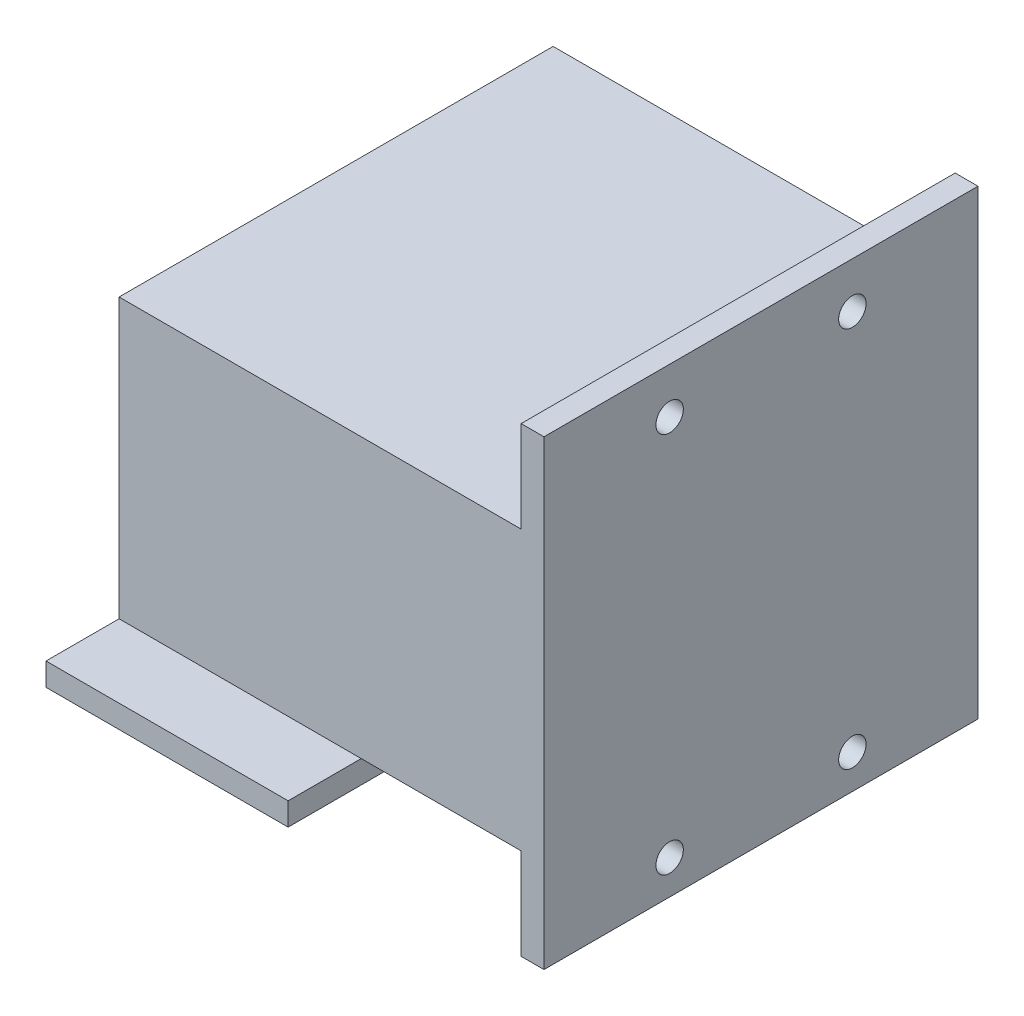
ISO-10303-21;
HEADER;
FILE_DESCRIPTION(('STEP AP214'),'2;1');
FILE_NAME('part.step','',(''),(''),'','','');
FILE_SCHEMA(('AUTOMOTIVE_DESIGN { 1 0 10303 214 1 1 1 1 }'));
ENDSEC;
DATA;
#1=APPLICATION_CONTEXT('core data for automotive mechanical design processes');
#2=APPLICATION_PROTOCOL_DEFINITION('international standard','automotive_design',2000,#1);
#3=PRODUCT_CONTEXT('',#1,'mechanical');
#4=PRODUCT('Part','Part','',(#3));
#5=PRODUCT_RELATED_PRODUCT_CATEGORY('part','',(#4));
#6=PRODUCT_DEFINITION_FORMATION('','',#4);
#7=PRODUCT_DEFINITION_CONTEXT('part definition',#1,'design');
#8=PRODUCT_DEFINITION('design','',#6,#7);
#9=PRODUCT_DEFINITION_SHAPE('','',#8);
#10=(LENGTH_UNIT() NAMED_UNIT(*) SI_UNIT(.MILLI.,.METRE.));
#11=(NAMED_UNIT(*) PLANE_ANGLE_UNIT() SI_UNIT($,.RADIAN.));
#12=(NAMED_UNIT(*) SI_UNIT($,.STERADIAN.) SOLID_ANGLE_UNIT());
#13=UNCERTAINTY_MEASURE_WITH_UNIT(LENGTH_MEASURE(1.E-05),#10,'distance_accuracy_value','');
#14=(GEOMETRIC_REPRESENTATION_CONTEXT(3) GLOBAL_UNCERTAINTY_ASSIGNED_CONTEXT((#13)) GLOBAL_UNIT_ASSIGNED_CONTEXT((#10,
#11,#12)) REPRESENTATION_CONTEXT('',''));
#15=CARTESIAN_POINT('',(0.,0.,0.));
#16=DIRECTION('',(0.,0.,1.));
#17=DIRECTION('',(1.,0.,0.));
#18=AXIS2_PLACEMENT_3D('',#15,#16,#17);
#19=CARTESIAN_POINT('',(34.2063972739642,2.5,26.204043298696));
#20=DIRECTION('',(0.,1.,0.));
#21=DIRECTION('',(0.,0.,1.));
#22=AXIS2_PLACEMENT_3D('',#19,#20,#21);
#23=PLANE('',#22);
#24=DIRECTION('',(0.,0.,1.));
#25=VECTOR('',#24,1.);
#26=CARTESIAN_POINT('',(31.7063972739642,2.50000000000001,26.204043298696));
#27=LINE('',#26,#25);
#28=CARTESIAN_POINT('',(31.7063972739642,2.50000000000001,-21.295956701304));
#29=VERTEX_POINT('',#28);
#30=CARTESIAN_POINT('',(31.7063972739642,2.50000000000001,26.204043298696));
#31=VERTEX_POINT('',#30);
#32=EDGE_CURVE('E234',#29,#31,#27,.T.);
#33=ORIENTED_EDGE('',*,*,#32,.T.);
#34=DIRECTION('',(-1.,0.,0.));
#35=VECTOR('',#34,1.);
#36=CARTESIAN_POINT('',(34.2063972739642,2.5,26.204043298696));
#37=LINE('',#36,#35);
#38=CARTESIAN_POINT('',(14.2063972739642,2.5,26.204043298696));
#39=VERTEX_POINT('',#38);
#40=EDGE_CURVE('E257',#31,#39,#37,.T.);
#41=ORIENTED_EDGE('',*,*,#40,.T.);
#42=DIRECTION('',(0.,0.,-1.));
#43=VECTOR('',#42,1.);
#44=CARTESIAN_POINT('',(14.2063972739642,2.5,26.204043298696));
#45=LINE('',#44,#43);
#46=CARTESIAN_POINT('',(14.2063972739642,2.5,-21.295956701304));
#47=VERTEX_POINT('',#46);
#48=EDGE_CURVE('E251',#39,#47,#45,.T.);
#49=ORIENTED_EDGE('',*,*,#48,.T.);
#50=DIRECTION('',(-1.,0.,0.));
#51=VECTOR('',#50,1.);
#52=CARTESIAN_POINT('',(34.2063972739642,2.5,-21.295956701304));
#53=LINE('',#52,#51);
#54=EDGE_CURVE('E210',#29,#47,#53,.T.);
#55=ORIENTED_EDGE('',*,*,#54,.F.);
#56=EDGE_LOOP('',(#33,#41,#49,#55));
#57=FACE_BOUND('',#56,.T.);
#58=ADVANCED_FACE('F43',(#57),#23,.F.);
#59=CARTESIAN_POINT('',(0.,33.,0.));
#60=DIRECTION('',(0.,1.,0.));
#61=DIRECTION('',(0.,0.,1.));
#62=AXIS2_PLACEMENT_3D('',#59,#60,#61);
#63=PLANE('',#62);
#64=DIRECTION('',(1.,0.,0.));
#65=VECTOR('',#64,1.);
#66=CARTESIAN_POINT('',(-12.2936027260358,33.,26.204043298696));
#67=LINE('',#66,#65);
#68=CARTESIAN_POINT('',(-12.2936027260358,33.,26.204043298696));
#69=VERTEX_POINT('',#68);
#70=CARTESIAN_POINT('',(31.7063972739642,33.,26.204043298696));
#71=VERTEX_POINT('',#70);
#72=EDGE_CURVE('E380',#69,#71,#67,.T.);
#73=ORIENTED_EDGE('',*,*,#72,.T.);
#74=DIRECTION('',(0.,0.,-1.));
#75=VECTOR('',#74,1.);
#76=CARTESIAN_POINT('',(31.7063972739642,33.,26.204043298696));
#77=LINE('',#76,#75);
#78=CARTESIAN_POINT('',(31.7063972739642,33.,-21.295956701304));
#79=VERTEX_POINT('',#78);
#80=EDGE_CURVE('E242',#71,#79,#77,.T.);
#81=ORIENTED_EDGE('',*,*,#80,.T.);
#82=DIRECTION('',(-1.,0.,0.));
#83=VECTOR('',#82,1.);
#84=CARTESIAN_POINT('',(-12.2936027260358,33.,-21.295956701304));
#85=LINE('',#84,#83);
#86=CARTESIAN_POINT('',(-12.2936027260358,33.,-21.295956701304));
#87=VERTEX_POINT('',#86);
#88=EDGE_CURVE('E384',#79,#87,#85,.T.);
#89=ORIENTED_EDGE('',*,*,#88,.T.);
#90=DIRECTION('',(0.,0.,1.));
#91=VECTOR('',#90,1.);
#92=CARTESIAN_POINT('',(-12.2936027260358,33.,-21.295956701304));
#93=LINE('',#92,#91);
#94=EDGE_CURVE('E377',#87,#69,#93,.T.);
#95=ORIENTED_EDGE('',*,*,#94,.T.);
#96=EDGE_LOOP('',(#73,#81,#89,#95));
#97=FACE_BOUND('',#96,.T.);
#98=ADVANCED_FACE('F422',(#97),#63,.T.);
#99=CARTESIAN_POINT('',(14.2063972739642,33.,-21.295956701304));
#100=DIRECTION('',(-1.,0.,0.));
#101=DIRECTION('',(0.,0.,1.));
#102=AXIS2_PLACEMENT_3D('',#99,#100,#101);
#103=PLANE('',#102);
#104=ORIENTED_EDGE('',*,*,#48,.F.);
#105=DIRECTION('',(0.,0.,1.));
#106=VECTOR('',#105,1.);
#107=CARTESIAN_POINT('',(14.2063972739642,2.5,26.204043298696));
#108=LINE('',#107,#106);
#109=CARTESIAN_POINT('',(14.2063972739642,2.5,34.204043298696));
#110=VERTEX_POINT('',#109);
#111=EDGE_CURVE('E304',#39,#110,#108,.T.);
#112=ORIENTED_EDGE('',*,*,#111,.T.);
#113=DIRECTION('',(0.,-1.,0.));
#114=VECTOR('',#113,1.);
#115=CARTESIAN_POINT('',(14.2063972739642,2.5,34.204043298696));
#116=LINE('',#115,#114);
#117=CARTESIAN_POINT('',(14.2063972739642,0.,34.204043298696));
#118=VERTEX_POINT('',#117);
#119=EDGE_CURVE('E310',#110,#118,#116,.T.);
#120=ORIENTED_EDGE('',*,*,#119,.T.);
#121=DIRECTION('',(0.,0.,-1.));
#122=VECTOR('',#121,1.);
#123=CARTESIAN_POINT('',(14.2063972739642,0.,-21.295956701304));
#124=LINE('',#123,#122);
#125=CARTESIAN_POINT('',(14.2063972739642,0.,-29.295956701304));
#126=VERTEX_POINT('',#125);
#127=EDGE_CURVE('E381',#118,#126,#124,.T.);
#128=ORIENTED_EDGE('',*,*,#127,.T.);
#129=DIRECTION('',(0.,-1.,0.));
#130=VECTOR('',#129,1.);
#131=CARTESIAN_POINT('',(14.2063972739642,2.5,-29.295956701304));
#132=LINE('',#131,#130);
#133=CARTESIAN_POINT('',(14.2063972739642,2.5,-29.295956701304));
#134=VERTEX_POINT('',#133);
#135=EDGE_CURVE('E259',#134,#126,#132,.T.);
#136=ORIENTED_EDGE('',*,*,#135,.F.);
#137=DIRECTION('',(0.,0.,1.));
#138=VECTOR('',#137,1.);
#139=CARTESIAN_POINT('',(14.2063972739642,2.5,-21.295956701304));
#140=LINE('',#139,#138);
#141=EDGE_CURVE('E272',#134,#47,#140,.T.);
#142=ORIENTED_EDGE('',*,*,#141,.T.);
#143=EDGE_LOOP('',(#104,#112,#120,#128,#136,#142));
#144=FACE_BOUND('',#143,.T.);
#145=ADVANCED_FACE('F413',(#144),#103,.F.);
#146=CARTESIAN_POINT('',(-12.2936027260358,33.,-21.295956701304));
#147=DIRECTION('',(0.,0.,1.));
#148=DIRECTION('',(1.,0.,0.));
#149=AXIS2_PLACEMENT_3D('',#146,#147,#148);
#150=PLANE('',#149);
#151=DIRECTION('',(-1.,0.,0.));
#152=VECTOR('',#151,1.);
#153=CARTESIAN_POINT('',(4.45639727396421,2.5,-21.295956701304));
#154=LINE('',#153,#152);
#155=CARTESIAN_POINT('',(4.45639727396421,2.5,-21.295956701304));
#156=VERTEX_POINT('',#155);
#157=EDGE_CURVE('E263',#47,#156,#154,.T.);
#158=ORIENTED_EDGE('',*,*,#157,.T.);
#159=DIRECTION('',(0.,-1.,0.));
#160=VECTOR('',#159,1.);
#161=CARTESIAN_POINT('',(4.45639727396421,0.,-21.295956701304));
#162=LINE('',#161,#160);
#163=CARTESIAN_POINT('',(4.4563972739642,30.5,-21.295956701304));
#164=VERTEX_POINT('',#163);
#165=EDGE_CURVE('E323',#164,#156,#162,.T.);
#166=ORIENTED_EDGE('',*,*,#165,.F.);
#167=DIRECTION('',(1.,0.,0.));
#168=VECTOR('',#167,1.);
#169=CARTESIAN_POINT('',(4.4563972739642,30.5,-21.295956701304));
#170=LINE('',#169,#168);
#171=CARTESIAN_POINT('',(-2.54360272603579,30.5,-21.295956701304));
#172=VERTEX_POINT('',#171);
#173=EDGE_CURVE('E328',#172,#164,#170,.T.);
#174=ORIENTED_EDGE('',*,*,#173,.F.);
#175=DIRECTION('',(0.,1.,0.));
#176=VECTOR('',#175,1.);
#177=CARTESIAN_POINT('',(-2.54360272603579,30.5,-21.295956701304));
#178=LINE('',#177,#176);
#179=CARTESIAN_POINT('',(-2.54360272603579,2.5,-21.295956701304));
#180=VERTEX_POINT('',#179);
#181=EDGE_CURVE('E316',#180,#172,#178,.T.);
#182=ORIENTED_EDGE('',*,*,#181,.F.);
#183=DIRECTION('',(-1.,0.,0.));
#184=VECTOR('',#183,1.);
#185=CARTESIAN_POINT('',(-2.54360272603579,2.5,-21.295956701304));
#186=LINE('',#185,#184);
#187=CARTESIAN_POINT('',(-12.2936027260358,2.5,-21.295956701304));
#188=VERTEX_POINT('',#187);
#189=EDGE_CURVE('E290',#180,#188,#186,.T.);
#190=ORIENTED_EDGE('',*,*,#189,.T.);
#191=DIRECTION('',(0.,-1.,0.));
#192=VECTOR('',#191,1.);
#193=CARTESIAN_POINT('',(-12.2936027260358,33.,-21.295956701304));
#194=LINE('',#193,#192);
#195=EDGE_CURVE('E51',#87,#188,#194,.T.);
#196=ORIENTED_EDGE('',*,*,#195,.F.);
#197=ORIENTED_EDGE('',*,*,#88,.F.);
#198=DIRECTION('',(0.,1.,0.));
#199=VECTOR('',#198,1.);
#200=CARTESIAN_POINT('',(31.7063972739642,33.,-21.295956701304));
#201=LINE('',#200,#199);
#202=CARTESIAN_POINT('',(31.7063972739642,43.,-21.295956701304));
#203=VERTEX_POINT('',#202);
#204=EDGE_CURVE('E58',#79,#203,#201,.T.);
#205=ORIENTED_EDGE('',*,*,#204,.T.);
#206=DIRECTION('',(1.,0.,0.));
#207=VECTOR('',#206,1.);
#208=CARTESIAN_POINT('',(31.7063972739642,43.,-21.295956701304));
#209=LINE('',#208,#207);
#210=CARTESIAN_POINT('',(34.2063972739642,43.,-21.295956701304));
#211=VERTEX_POINT('',#210);
#212=EDGE_CURVE('E205',#203,#211,#209,.T.);
#213=ORIENTED_EDGE('',*,*,#212,.T.);
#214=DIRECTION('',(0.,1.,0.));
#215=VECTOR('',#214,1.);
#216=CARTESIAN_POINT('',(34.2063972739642,33.,-21.295956701304));
#217=LINE('',#216,#215);
#218=CARTESIAN_POINT('',(34.2063972739642,-7.49999999999999,-21.295956701304));
#219=VERTEX_POINT('',#218);
#220=EDGE_CURVE('E199',#219,#211,#217,.T.);
#221=ORIENTED_EDGE('',*,*,#220,.F.);
#222=DIRECTION('',(1.,0.,0.));
#223=VECTOR('',#222,1.);
#224=CARTESIAN_POINT('',(31.7063972739642,-7.49999999999999,-21.295956701304));
#225=LINE('',#224,#223);
#226=CARTESIAN_POINT('',(31.7063972739642,-7.49999999999999,-21.295956701304));
#227=VERTEX_POINT('',#226);
#228=EDGE_CURVE('E203',#227,#219,#225,.T.);
#229=ORIENTED_EDGE('',*,*,#228,.F.);
#230=DIRECTION('',(0.,1.,0.));
#231=VECTOR('',#230,1.);
#232=CARTESIAN_POINT('',(31.7063972739642,2.50000000000001,-21.295956701304));
#233=LINE('',#232,#231);
#234=EDGE_CURVE('E237',#227,#29,#233,.T.);
#235=ORIENTED_EDGE('',*,*,#234,.T.);
#236=ORIENTED_EDGE('',*,*,#54,.T.);
#237=EDGE_LOOP('',(#158,#166,#174,#182,#190,#196,#197,#205,#213,#221,#229,#235,#236));
#238=FACE_BOUND('',#237,.T.);
#239=ADVANCED_FACE('F202',(#238),#150,.F.);
#240=CARTESIAN_POINT('',(-9.79360272603579,33.,-18.795956701304));
#241=DIRECTION('',(0.,0.,1.));
#242=DIRECTION('',(1.,0.,0.));
#243=AXIS2_PLACEMENT_3D('',#240,#241,#242);
#244=PLANE('',#243);
#245=DIRECTION('',(0.,-1.,0.));
#246=VECTOR('',#245,1.);
#247=CARTESIAN_POINT('',(4.45639727396421,0.,-18.795956701304));
#248=LINE('',#247,#246);
#249=CARTESIAN_POINT('',(4.45639727396421,30.5,-18.795956701304));
#250=VERTEX_POINT('',#249);
#251=CARTESIAN_POINT('',(4.45639727396421,0.,-18.795956701304));
#252=VERTEX_POINT('',#251);
#253=EDGE_CURVE('E322',#250,#252,#248,.T.);
#254=ORIENTED_EDGE('',*,*,#253,.T.);
#255=DIRECTION('',(-1.,0.,0.));
#256=VECTOR('',#255,1.);
#257=CARTESIAN_POINT('',(-9.79360272603579,0.,-18.795956701304));
#258=LINE('',#257,#256);
#259=CARTESIAN_POINT('',(11.7063972739642,0.,-18.795956701304));
#260=VERTEX_POINT('',#259);
#261=EDGE_CURVE('E364',#260,#252,#258,.T.);
#262=ORIENTED_EDGE('',*,*,#261,.F.);
#263=DIRECTION('',(0.,-1.,0.));
#264=VECTOR('',#263,1.);
#265=CARTESIAN_POINT('',(11.7063972739642,33.,-18.795956701304));
#266=LINE('',#265,#264);
#267=CARTESIAN_POINT('',(11.7063972739642,30.5,-18.795956701304));
#268=VERTEX_POINT('',#267);
#269=EDGE_CURVE('E370',#268,#260,#266,.T.);
#270=ORIENTED_EDGE('',*,*,#269,.F.);
#271=DIRECTION('',(-1.,0.,0.));
#272=VECTOR('',#271,1.);
#273=CARTESIAN_POINT('',(-9.79360272603579,30.5,-18.795956701304));
#274=LINE('',#273,#272);
#275=EDGE_CURVE('E351',#268,#250,#274,.T.);
#276=ORIENTED_EDGE('',*,*,#275,.T.);
#277=EDGE_LOOP('',(#254,#262,#270,#276));
#278=FACE_BOUND('',#277,.T.);
#279=ADVANCED_FACE('F507',(#278),#244,.T.);
#280=CARTESIAN_POINT('',(-9.79360272603579,33.,23.704043298696));
#281=DIRECTION('',(1.,0.,0.));
#282=DIRECTION('',(0.,0.,-1.));
#283=AXIS2_PLACEMENT_3D('',#280,#281,#282);
#284=PLANE('',#283);
#285=DIRECTION('',(0.,-1.,0.));
#286=VECTOR('',#285,1.);
#287=CARTESIAN_POINT('',(-9.79360272603579,33.,-18.795956701304));
#288=LINE('',#287,#286);
#289=CARTESIAN_POINT('',(-9.79360272603579,30.5,-18.795956701304));
#290=VERTEX_POINT('',#289);
#291=CARTESIAN_POINT('',(-9.79360272603579,0.,-18.795956701304));
#292=VERTEX_POINT('',#291);
#293=EDGE_CURVE('E367',#290,#292,#288,.T.);
#294=ORIENTED_EDGE('',*,*,#293,.F.);
#295=DIRECTION('',(0.,0.,1.));
#296=VECTOR('',#295,1.);
#297=CARTESIAN_POINT('',(-9.79360272603579,30.5,-18.795956701304));
#298=LINE('',#297,#296);
#299=CARTESIAN_POINT('',(-9.79360272603579,30.5,23.704043298696));
#300=VERTEX_POINT('',#299);
#301=EDGE_CURVE('E335',#290,#300,#298,.T.);
#302=ORIENTED_EDGE('',*,*,#301,.T.);
#303=DIRECTION('',(0.,-1.,0.));
#304=VECTOR('',#303,1.);
#305=CARTESIAN_POINT('',(-9.79360272603579,33.,23.704043298696));
#306=LINE('',#305,#304);
#307=CARTESIAN_POINT('',(-9.79360272603579,0.,23.704043298696));
#308=VERTEX_POINT('',#307);
#309=EDGE_CURVE('E374',#300,#308,#306,.T.);
#310=ORIENTED_EDGE('',*,*,#309,.T.);
#311=DIRECTION('',(0.,0.,1.));
#312=VECTOR('',#311,1.);
#313=CARTESIAN_POINT('',(-9.79360272603579,0.,23.704043298696));
#314=LINE('',#313,#312);
#315=EDGE_CURVE('E354',#292,#308,#314,.T.);
#316=ORIENTED_EDGE('',*,*,#315,.F.);
#317=EDGE_LOOP('',(#294,#302,#310,#316));
#318=FACE_BOUND('',#317,.T.);
#319=ADVANCED_FACE('F514',(#318),#284,.T.);
#320=CARTESIAN_POINT('',(-9.79360272603579,33.,23.704043298696));
#321=DIRECTION('',(0.,0.,-1.));
#322=DIRECTION('',(-1.,0.,0.));
#323=AXIS2_PLACEMENT_3D('',#320,#321,#322);
#324=PLANE('',#323);
#325=ORIENTED_EDGE('',*,*,#309,.F.);
#326=DIRECTION('',(1.,0.,0.));
#327=VECTOR('',#326,1.);
#328=CARTESIAN_POINT('',(-9.79360272603579,30.5,23.704043298696));
#329=LINE('',#328,#327);
#330=CARTESIAN_POINT('',(11.7063972739642,30.5,23.704043298696));
#331=VERTEX_POINT('',#330);
#332=EDGE_CURVE('E344',#300,#331,#329,.T.);
#333=ORIENTED_EDGE('',*,*,#332,.T.);
#334=DIRECTION('',(0.,-1.,0.));
#335=VECTOR('',#334,1.);
#336=CARTESIAN_POINT('',(11.7063972739642,33.,23.704043298696));
#337=LINE('',#336,#335);
#338=CARTESIAN_POINT('',(11.7063972739642,0.,23.704043298696));
#339=VERTEX_POINT('',#338);
#340=EDGE_CURVE('E372',#331,#339,#337,.T.);
#341=ORIENTED_EDGE('',*,*,#340,.T.);
#342=DIRECTION('',(1.,0.,0.));
#343=VECTOR('',#342,1.);
#344=CARTESIAN_POINT('',(-9.79360272603579,0.,23.704043298696));
#345=LINE('',#344,#343);
#346=EDGE_CURVE('E357',#308,#339,#345,.T.);
#347=ORIENTED_EDGE('',*,*,#346,.F.);
#348=EDGE_LOOP('',(#325,#333,#341,#347));
#349=FACE_BOUND('',#348,.T.);
#350=ADVANCED_FACE('F510',(#349),#324,.T.);
#351=CARTESIAN_POINT('',(11.7063972739642,33.,23.704043298696));
#352=DIRECTION('',(-1.,0.,0.));
#353=DIRECTION('',(0.,0.,1.));
#354=AXIS2_PLACEMENT_3D('',#351,#352,#353);
#355=PLANE('',#354);
#356=ORIENTED_EDGE('',*,*,#340,.F.);
#357=DIRECTION('',(0.,0.,-1.));
#358=VECTOR('',#357,1.);
#359=CARTESIAN_POINT('',(11.7063972739642,30.5,-18.795956701304));
#360=LINE('',#359,#358);
#361=EDGE_CURVE('E347',#331,#268,#360,.T.);
#362=ORIENTED_EDGE('',*,*,#361,.T.);
#363=ORIENTED_EDGE('',*,*,#269,.T.);
#364=DIRECTION('',(0.,0.,-1.));
#365=VECTOR('',#364,1.);
#366=CARTESIAN_POINT('',(11.7063972739642,0.,23.704043298696));
#367=LINE('',#366,#365);
#368=EDGE_CURVE('E360',#339,#260,#367,.T.);
#369=ORIENTED_EDGE('',*,*,#368,.F.);
#370=EDGE_LOOP('',(#356,#362,#363,#369));
#371=FACE_BOUND('',#370,.T.);
#372=ADVANCED_FACE('F505',(#371),#355,.T.);
#373=DIRECTION('',(0.,1.,0.));
#374=VECTOR('',#373,1.);
#375=CARTESIAN_POINT('',(-2.54360272603579,30.5,-18.795956701304));
#376=LINE('',#375,#374);
#377=CARTESIAN_POINT('',(-2.54360272603579,0.,-18.795956701304));
#378=VERTEX_POINT('',#377);
#379=CARTESIAN_POINT('',(-2.54360272603579,30.5,-18.795956701304));
#380=VERTEX_POINT('',#379);
#381=EDGE_CURVE('E319',#378,#380,#376,.T.);
#382=ORIENTED_EDGE('',*,*,#381,.T.);
#383=EDGE_CURVE('E350',#380,#290,#274,.T.);
#384=ORIENTED_EDGE('',*,*,#383,.T.);
#385=ORIENTED_EDGE('',*,*,#293,.T.);
#386=EDGE_CURVE('E363',#378,#292,#258,.T.);
#387=ORIENTED_EDGE('',*,*,#386,.F.);
#388=EDGE_LOOP('',(#382,#384,#385,#387));
#389=FACE_BOUND('',#388,.T.);
#390=ADVANCED_FACE('F502',(#389),#244,.T.);
#391=CARTESIAN_POINT('',(0.,0.,0.));
#392=DIRECTION('',(0.,1.,0.));
#393=DIRECTION('',(0.,0.,1.));
#394=AXIS2_PLACEMENT_3D('',#391,#392,#393);
#395=PLANE('',#394);
#396=ORIENTED_EDGE('',*,*,#261,.T.);
#397=DIRECTION('',(0.,0.,-1.));
#398=VECTOR('',#397,1.);
#399=CARTESIAN_POINT('',(4.45639727396421,0.,-18.795956701304));
#400=LINE('',#399,#398);
#401=CARTESIAN_POINT('',(4.45639727396421,0.,-29.295956701304));
#402=VERTEX_POINT('',#401);
#403=EDGE_CURVE('E333',#252,#402,#400,.T.);
#404=ORIENTED_EDGE('',*,*,#403,.T.);
#405=DIRECTION('',(1.,0.,0.));
#406=VECTOR('',#405,1.);
#407=CARTESIAN_POINT('',(4.45639727396421,0.,-29.295956701304));
#408=LINE('',#407,#406);
#409=EDGE_CURVE('E266',#402,#126,#408,.T.);
#410=ORIENTED_EDGE('',*,*,#409,.T.);
#411=ORIENTED_EDGE('',*,*,#127,.F.);
#412=DIRECTION('',(-1.,0.,0.));
#413=VECTOR('',#412,1.);
#414=CARTESIAN_POINT('',(-12.2936027260358,0.,34.204043298696));
#415=LINE('',#414,#413);
#416=CARTESIAN_POINT('',(-12.2936027260358,0.,34.204043298696));
#417=VERTEX_POINT('',#416);
#418=EDGE_CURVE('E289',#118,#417,#415,.T.);
#419=ORIENTED_EDGE('',*,*,#418,.T.);
#420=DIRECTION('',(0.,0.,1.));
#421=VECTOR('',#420,1.);
#422=CARTESIAN_POINT('',(-12.2936027260358,0.,-21.295956701304));
#423=LINE('',#422,#421);
#424=CARTESIAN_POINT('',(-12.2936027260358,0.,-29.295956701304));
#425=VERTEX_POINT('',#424);
#426=EDGE_CURVE('E376',#425,#417,#423,.T.);
#427=ORIENTED_EDGE('',*,*,#426,.F.);
#428=DIRECTION('',(1.,0.,0.));
#429=VECTOR('',#428,1.);
#430=CARTESIAN_POINT('',(-12.2936027260358,0.,-29.295956701304));
#431=LINE('',#430,#429);
#432=CARTESIAN_POINT('',(-2.54360272603579,0.,-29.295956701304));
#433=VERTEX_POINT('',#432);
#434=EDGE_CURVE('E286',#425,#433,#431,.T.);
#435=ORIENTED_EDGE('',*,*,#434,.T.);
#436=DIRECTION('',(0.,0.,-1.));
#437=VECTOR('',#436,1.);
#438=CARTESIAN_POINT('',(-2.54360272603579,0.,-18.795956701304));
#439=LINE('',#438,#437);
#440=EDGE_CURVE('E326',#378,#433,#439,.T.);
#441=ORIENTED_EDGE('',*,*,#440,.F.);
#442=ORIENTED_EDGE('',*,*,#386,.T.);
#443=ORIENTED_EDGE('',*,*,#315,.T.);
#444=ORIENTED_EDGE('',*,*,#346,.T.);
#445=ORIENTED_EDGE('',*,*,#368,.T.);
#446=EDGE_LOOP('',(#396,#404,#410,#411,#419,#427,#435,#441,#442,#443,#444,#445));
#447=FACE_BOUND('',#446,.T.);
#448=ADVANCED_FACE('F409',(#447),#395,.F.);
#449=CARTESIAN_POINT('',(-12.2936027260358,33.,-21.295956701304));
#450=DIRECTION('',(1.,0.,0.));
#451=DIRECTION('',(0.,0.,-1.));
#452=AXIS2_PLACEMENT_3D('',#449,#450,#451);
#453=PLANE('',#452);
#454=ORIENTED_EDGE('',*,*,#426,.T.);
#455=DIRECTION('',(0.,-1.,0.));
#456=VECTOR('',#455,1.);
#457=CARTESIAN_POINT('',(-12.2936027260358,2.5,34.204043298696));
#458=LINE('',#457,#456);
#459=CARTESIAN_POINT('',(-12.2936027260358,2.5,34.204043298696));
#460=VERTEX_POINT('',#459);
#461=EDGE_CURVE('E313',#460,#417,#458,.T.);
#462=ORIENTED_EDGE('',*,*,#461,.F.);
#463=DIRECTION('',(0.,0.,-1.));
#464=VECTOR('',#463,1.);
#465=CARTESIAN_POINT('',(-12.2936027260358,2.5,26.204043298696));
#466=LINE('',#465,#464);
#467=CARTESIAN_POINT('',(-12.2936027260358,2.5,26.204043298696));
#468=VERTEX_POINT('',#467);
#469=EDGE_CURVE('E298',#460,#468,#466,.T.);
#470=ORIENTED_EDGE('',*,*,#469,.T.);
#471=DIRECTION('',(0.,-1.,0.));
#472=VECTOR('',#471,1.);
#473=CARTESIAN_POINT('',(-12.2936027260358,33.,26.204043298696));
#474=LINE('',#473,#472);
#475=EDGE_CURVE('E11',#69,#468,#474,.T.);
#476=ORIENTED_EDGE('',*,*,#475,.F.);
#477=ORIENTED_EDGE('',*,*,#94,.F.);
#478=ORIENTED_EDGE('',*,*,#195,.T.);
#479=DIRECTION('',(0.,0.,-1.));
#480=VECTOR('',#479,1.);
#481=CARTESIAN_POINT('',(-12.2936027260358,2.5,-21.295956701304));
#482=LINE('',#481,#480);
#483=CARTESIAN_POINT('',(-12.2936027260358,2.5,-29.295956701304));
#484=VERTEX_POINT('',#483);
#485=EDGE_CURVE('E66',#188,#484,#482,.T.);
#486=ORIENTED_EDGE('',*,*,#485,.T.);
#487=DIRECTION('',(0.,-1.,0.));
#488=VECTOR('',#487,1.);
#489=CARTESIAN_POINT('',(-12.2936027260358,2.5,-29.295956701304));
#490=LINE('',#489,#488);
#491=EDGE_CURVE('E280',#484,#425,#490,.T.);
#492=ORIENTED_EDGE('',*,*,#491,.T.);
#493=EDGE_LOOP('',(#454,#462,#470,#476,#477,#478,#486,#492));
#494=FACE_BOUND('',#493,.T.);
#495=ADVANCED_FACE('F45',(#494),#453,.F.);
#496=CARTESIAN_POINT('',(-12.2936027260358,33.,26.204043298696));
#497=DIRECTION('',(0.,0.,-1.));
#498=DIRECTION('',(-1.,0.,0.));
#499=AXIS2_PLACEMENT_3D('',#496,#497,#498);
#500=PLANE('',#499);
#501=ORIENTED_EDGE('',*,*,#475,.T.);
#502=DIRECTION('',(1.,0.,0.));
#503=VECTOR('',#502,1.);
#504=CARTESIAN_POINT('',(-12.2936027260358,2.5,26.204043298696));
#505=LINE('',#504,#503);
#506=EDGE_CURVE('E301',#468,#39,#505,.T.);
#507=ORIENTED_EDGE('',*,*,#506,.T.);
#508=ORIENTED_EDGE('',*,*,#40,.F.);
#509=DIRECTION('',(0.,-1.,0.));
#510=VECTOR('',#509,1.);
#511=CARTESIAN_POINT('',(31.7063972739642,2.50000000000001,26.204043298696));
#512=LINE('',#511,#510);
#513=CARTESIAN_POINT('',(31.7063972739642,-7.49999999999999,26.204043298696));
#514=VERTEX_POINT('',#513);
#515=EDGE_CURVE('E226',#31,#514,#512,.T.);
#516=ORIENTED_EDGE('',*,*,#515,.T.);
#517=DIRECTION('',(1.,0.,0.));
#518=VECTOR('',#517,1.);
#519=CARTESIAN_POINT('',(31.7063972739642,-7.49999999999999,26.204043298696));
#520=LINE('',#519,#518);
#521=CARTESIAN_POINT('',(34.2063972739642,-7.49999999999999,26.204043298696));
#522=VERTEX_POINT('',#521);
#523=EDGE_CURVE('E220',#514,#522,#520,.T.);
#524=ORIENTED_EDGE('',*,*,#523,.T.);
#525=DIRECTION('',(0.,-1.,0.));
#526=VECTOR('',#525,1.);
#527=CARTESIAN_POINT('',(34.2063972739642,33.,26.204043298696));
#528=LINE('',#527,#526);
#529=CARTESIAN_POINT('',(34.2063972739642,43.,26.204043298696));
#530=VERTEX_POINT('',#529);
#531=EDGE_CURVE('E211',#530,#522,#528,.T.);
#532=ORIENTED_EDGE('',*,*,#531,.F.);
#533=DIRECTION('',(1.,0.,0.));
#534=VECTOR('',#533,1.);
#535=CARTESIAN_POINT('',(31.7063972739642,43.,26.204043298696));
#536=LINE('',#535,#534);
#537=CARTESIAN_POINT('',(31.7063972739642,43.,26.204043298696));
#538=VERTEX_POINT('',#537);
#539=EDGE_CURVE('E248',#538,#530,#536,.T.);
#540=ORIENTED_EDGE('',*,*,#539,.F.);
#541=DIRECTION('',(0.,-1.,0.));
#542=VECTOR('',#541,1.);
#543=CARTESIAN_POINT('',(31.7063972739642,33.,26.204043298696));
#544=LINE('',#543,#542);
#545=EDGE_CURVE('E228',#538,#71,#544,.T.);
#546=ORIENTED_EDGE('',*,*,#545,.T.);
#547=ORIENTED_EDGE('',*,*,#72,.F.);
#548=EDGE_LOOP('',(#501,#507,#508,#516,#524,#532,#540,#546,#547));
#549=FACE_BOUND('',#548,.T.);
#550=ADVANCED_FACE('F418',(#549),#500,.F.);
#551=CARTESIAN_POINT('',(0.,30.5,0.));
#552=DIRECTION('',(0.,1.,0.));
#553=DIRECTION('',(0.,0.,1.));
#554=AXIS2_PLACEMENT_3D('',#551,#552,#553);
#555=PLANE('',#554);
#556=ORIENTED_EDGE('',*,*,#301,.F.);
#557=ORIENTED_EDGE('',*,*,#383,.F.);
#558=DIRECTION('',(0.,0.,-1.));
#559=VECTOR('',#558,1.);
#560=CARTESIAN_POINT('',(-2.54360272603579,30.5,-18.795956701304));
#561=LINE('',#560,#559);
#562=EDGE_CURVE('E338',#380,#172,#561,.T.);
#563=ORIENTED_EDGE('',*,*,#562,.T.);
#564=ORIENTED_EDGE('',*,*,#173,.T.);
#565=DIRECTION('',(0.,0.,-1.));
#566=VECTOR('',#565,1.);
#567=CARTESIAN_POINT('',(4.4563972739642,30.5,-18.795956701304));
#568=LINE('',#567,#566);
#569=EDGE_CURVE('E336',#250,#164,#568,.T.);
#570=ORIENTED_EDGE('',*,*,#569,.F.);
#571=ORIENTED_EDGE('',*,*,#275,.F.);
#572=ORIENTED_EDGE('',*,*,#361,.F.);
#573=ORIENTED_EDGE('',*,*,#332,.F.);
#574=EDGE_LOOP('',(#556,#557,#563,#564,#570,#571,#572,#573));
#575=FACE_BOUND('',#574,.T.);
#576=ADVANCED_FACE('F495',(#575),#555,.F.);
#577=CARTESIAN_POINT('',(4.45639727396421,0.,-18.795956701304));
#578=DIRECTION('',(1.,0.,0.));
#579=DIRECTION('',(0.,1.,0.));
#580=AXIS2_PLACEMENT_3D('',#577,#578,#579);
#581=PLANE('',#580);
#582=ORIENTED_EDGE('',*,*,#165,.T.);
#583=DIRECTION('',(0.,0.,-1.));
#584=VECTOR('',#583,1.);
#585=CARTESIAN_POINT('',(4.45639727396421,2.5,-21.295956701304));
#586=LINE('',#585,#584);
#587=CARTESIAN_POINT('',(4.45639727396421,2.5,-29.295956701304));
#588=VERTEX_POINT('',#587);
#589=EDGE_CURVE('E270',#156,#588,#586,.T.);
#590=ORIENTED_EDGE('',*,*,#589,.T.);
#591=DIRECTION('',(0.,-1.,0.));
#592=VECTOR('',#591,1.);
#593=CARTESIAN_POINT('',(4.45639727396421,2.5,-29.295956701304));
#594=LINE('',#593,#592);
#595=EDGE_CURVE('E260',#588,#402,#594,.T.);
#596=ORIENTED_EDGE('',*,*,#595,.T.);
#597=ORIENTED_EDGE('',*,*,#403,.F.);
#598=ORIENTED_EDGE('',*,*,#253,.F.);
#599=ORIENTED_EDGE('',*,*,#569,.T.);
#600=EDGE_LOOP('',(#582,#590,#596,#597,#598,#599));
#601=FACE_BOUND('',#600,.T.);
#602=ADVANCED_FACE('F492',(#601),#581,.F.);
#603=CARTESIAN_POINT('',(-2.54360272603579,30.5,-18.795956701304));
#604=DIRECTION('',(-1.,0.,0.));
#605=DIRECTION('',(0.,-1.,0.));
#606=AXIS2_PLACEMENT_3D('',#603,#604,#605);
#607=PLANE('',#606);
#608=ORIENTED_EDGE('',*,*,#440,.T.);
#609=DIRECTION('',(0.,-1.,0.));
#610=VECTOR('',#609,1.);
#611=CARTESIAN_POINT('',(-2.54360272603579,2.5,-29.295956701304));
#612=LINE('',#611,#610);
#613=CARTESIAN_POINT('',(-2.54360272603579,2.5,-29.295956701304));
#614=VERTEX_POINT('',#613);
#615=EDGE_CURVE('E269',#614,#433,#612,.T.);
#616=ORIENTED_EDGE('',*,*,#615,.F.);
#617=DIRECTION('',(0.,0.,1.));
#618=VECTOR('',#617,1.);
#619=CARTESIAN_POINT('',(-2.54360272603579,2.5,-29.295956701304));
#620=LINE('',#619,#618);
#621=EDGE_CURVE('E283',#614,#180,#620,.T.);
#622=ORIENTED_EDGE('',*,*,#621,.T.);
#623=ORIENTED_EDGE('',*,*,#181,.T.);
#624=ORIENTED_EDGE('',*,*,#562,.F.);
#625=ORIENTED_EDGE('',*,*,#381,.F.);
#626=EDGE_LOOP('',(#608,#616,#622,#623,#624,#625));
#627=FACE_BOUND('',#626,.T.);
#628=ADVANCED_FACE('F398',(#627),#607,.F.);
#629=CARTESIAN_POINT('',(-12.2936027260358,2.5,34.204043298696));
#630=DIRECTION('',(0.,0.,1.));
#631=DIRECTION('',(1.,0.,0.));
#632=AXIS2_PLACEMENT_3D('',#629,#630,#631);
#633=PLANE('',#632);
#634=ORIENTED_EDGE('',*,*,#418,.F.);
#635=ORIENTED_EDGE('',*,*,#119,.F.);
#636=DIRECTION('',(-1.,0.,0.));
#637=VECTOR('',#636,1.);
#638=CARTESIAN_POINT('',(-12.2936027260358,2.5,34.204043298696));
#639=LINE('',#638,#637);
#640=EDGE_CURVE('E307',#110,#460,#639,.T.);
#641=ORIENTED_EDGE('',*,*,#640,.T.);
#642=ORIENTED_EDGE('',*,*,#461,.T.);
#643=EDGE_LOOP('',(#634,#635,#641,#642));
#644=FACE_BOUND('',#643,.T.);
#645=ADVANCED_FACE('F407',(#644),#633,.T.);
#646=CARTESIAN_POINT('',(0.,2.5,0.));
#647=DIRECTION('',(0.,1.,0.));
#648=DIRECTION('',(0.,0.,1.));
#649=AXIS2_PLACEMENT_3D('',#646,#647,#648);
#650=PLANE('',#649);
#651=ORIENTED_EDGE('',*,*,#469,.F.);
#652=ORIENTED_EDGE('',*,*,#640,.F.);
#653=ORIENTED_EDGE('',*,*,#111,.F.);
#654=ORIENTED_EDGE('',*,*,#506,.F.);
#655=EDGE_LOOP('',(#651,#652,#653,#654));
#656=FACE_BOUND('',#655,.T.);
#657=ADVANCED_FACE('F416',(#656),#650,.T.);
#658=CARTESIAN_POINT('',(-12.2936027260358,2.5,-29.295956701304));
#659=DIRECTION('',(0.,0.,-1.));
#660=DIRECTION('',(-1.,0.,0.));
#661=AXIS2_PLACEMENT_3D('',#658,#659,#660);
#662=PLANE('',#661);
#663=ORIENTED_EDGE('',*,*,#434,.F.);
#664=ORIENTED_EDGE('',*,*,#491,.F.);
#665=DIRECTION('',(1.,0.,0.));
#666=VECTOR('',#665,1.);
#667=CARTESIAN_POINT('',(-12.2936027260358,2.5,-29.295956701304));
#668=LINE('',#667,#666);
#669=EDGE_CURVE('E293',#484,#614,#668,.T.);
#670=ORIENTED_EDGE('',*,*,#669,.T.);
#671=ORIENTED_EDGE('',*,*,#615,.T.);
#672=EDGE_LOOP('',(#663,#664,#670,#671));
#673=FACE_BOUND('',#672,.T.);
#674=ADVANCED_FACE('F402',(#673),#662,.T.);
#675=CARTESIAN_POINT('',(0.,2.5,0.));
#676=DIRECTION('',(0.,-1.,0.));
#677=DIRECTION('',(0.,0.,-1.));
#678=AXIS2_PLACEMENT_3D('',#675,#676,#677);
#679=PLANE('',#678);
#680=ORIENTED_EDGE('',*,*,#189,.F.);
#681=ORIENTED_EDGE('',*,*,#621,.F.);
#682=ORIENTED_EDGE('',*,*,#669,.F.);
#683=ORIENTED_EDGE('',*,*,#485,.F.);
#684=EDGE_LOOP('',(#680,#681,#682,#683));
#685=FACE_BOUND('',#684,.T.);
#686=ADVANCED_FACE('F396',(#685),#679,.F.);
#687=CARTESIAN_POINT('',(4.45639727396421,2.5,-29.295956701304));
#688=DIRECTION('',(0.,0.,-1.));
#689=DIRECTION('',(-1.,0.,0.));
#690=AXIS2_PLACEMENT_3D('',#687,#688,#689);
#691=PLANE('',#690);
#692=ORIENTED_EDGE('',*,*,#409,.F.);
#693=ORIENTED_EDGE('',*,*,#595,.F.);
#694=DIRECTION('',(1.,0.,0.));
#695=VECTOR('',#694,1.);
#696=CARTESIAN_POINT('',(4.45639727396421,2.5,-29.295956701304));
#697=LINE('',#696,#695);
#698=EDGE_CURVE('E275',#588,#134,#697,.T.);
#699=ORIENTED_EDGE('',*,*,#698,.T.);
#700=ORIENTED_EDGE('',*,*,#135,.T.);
#701=EDGE_LOOP('',(#692,#693,#699,#700));
#702=FACE_BOUND('',#701,.T.);
#703=ADVANCED_FACE('F477',(#702),#691,.T.);
#704=CARTESIAN_POINT('',(0.,2.5,0.));
#705=DIRECTION('',(0.,-1.,0.));
#706=DIRECTION('',(0.,0.,-1.));
#707=AXIS2_PLACEMENT_3D('',#704,#705,#706);
#708=PLANE('',#707);
#709=ORIENTED_EDGE('',*,*,#589,.F.);
#710=ORIENTED_EDGE('',*,*,#157,.F.);
#711=ORIENTED_EDGE('',*,*,#141,.F.);
#712=ORIENTED_EDGE('',*,*,#698,.F.);
#713=EDGE_LOOP('',(#709,#710,#711,#712));
#714=FACE_BOUND('',#713,.T.);
#715=ADVANCED_FACE('F480',(#714),#708,.F.);
#716=CARTESIAN_POINT('',(34.2063972739642,0.,0.));
#717=DIRECTION('',(1.,0.,0.));
#718=DIRECTION('',(0.,0.,-1.));
#719=AXIS2_PLACEMENT_3D('',#716,#717,#718);
#720=PLANE('',#719);
#721=CARTESIAN_POINT('',(34.2063972739642,-3.75,12.454043298696));
#722=DIRECTION('',(1.,0.,0.));
#723=DIRECTION('',(0.,0.,-1.));
#724=AXIS2_PLACEMENT_3D('',#721,#722,#723);
#725=CIRCLE('',#724,1.5);
#726=CARTESIAN_POINT('',(34.2063972739642,-3.75,10.954043298696));
#727=VERTEX_POINT('',#726);
#728=EDGE_CURVE('E432',#727,#727,#725,.T.);
#729=ORIENTED_EDGE('',*,*,#728,.F.);
#730=EDGE_LOOP('',(#729));
#731=FACE_BOUND('',#730,.T.);
#732=CARTESIAN_POINT('',(34.2063972739642,38.,-7.54595670130404));
#733=DIRECTION('',(1.,0.,0.));
#734=DIRECTION('',(0.,0.,-1.));
#735=AXIS2_PLACEMENT_3D('',#732,#733,#734);
#736=CIRCLE('',#735,1.5);
#737=CARTESIAN_POINT('',(34.2063972739642,38.,-9.04595670130404));
#738=VERTEX_POINT('',#737);
#739=EDGE_CURVE('E221',#738,#738,#736,.T.);
#740=ORIENTED_EDGE('',*,*,#739,.F.);
#741=EDGE_LOOP('',(#740));
#742=FACE_BOUND('',#741,.T.);
#743=CARTESIAN_POINT('',(34.2063972739642,38.,12.454043298696));
#744=DIRECTION('',(1.,0.,0.));
#745=DIRECTION('',(0.,0.,-1.));
#746=AXIS2_PLACEMENT_3D('',#743,#744,#745);
#747=CIRCLE('',#746,1.5);
#748=CARTESIAN_POINT('',(34.2063972739642,38.,10.954043298696));
#749=VERTEX_POINT('',#748);
#750=EDGE_CURVE('E429',#749,#749,#747,.T.);
#751=ORIENTED_EDGE('',*,*,#750,.F.);
#752=EDGE_LOOP('',(#751));
#753=FACE_BOUND('',#752,.T.);
#754=CARTESIAN_POINT('',(34.2063972739642,-3.75,-7.54595670130404));
#755=DIRECTION('',(1.,0.,0.));
#756=DIRECTION('',(0.,0.,-1.));
#757=AXIS2_PLACEMENT_3D('',#754,#755,#756);
#758=CIRCLE('',#757,1.5);
#759=CARTESIAN_POINT('',(34.2063972739642,-3.75,-9.04595670130404));
#760=VERTEX_POINT('',#759);
#761=EDGE_CURVE('E435',#760,#760,#758,.T.);
#762=ORIENTED_EDGE('',*,*,#761,.F.);
#763=EDGE_LOOP('',(#762));
#764=FACE_BOUND('',#763,.T.);
#765=ORIENTED_EDGE('',*,*,#531,.T.);
#766=DIRECTION('',(0.,0.,-1.));
#767=VECTOR('',#766,1.);
#768=CARTESIAN_POINT('',(34.2063972739642,-7.49999999999999,26.204043298696));
#769=LINE('',#768,#767);
#770=EDGE_CURVE('E217',#522,#219,#769,.T.);
#771=ORIENTED_EDGE('',*,*,#770,.T.);
#772=ORIENTED_EDGE('',*,*,#220,.T.);
#773=DIRECTION('',(0.,0.,1.));
#774=VECTOR('',#773,1.);
#775=CARTESIAN_POINT('',(34.2063972739642,43.,26.204043298696));
#776=LINE('',#775,#774);
#777=EDGE_CURVE('E225',#211,#530,#776,.T.);
#778=ORIENTED_EDGE('',*,*,#777,.T.);
#779=EDGE_LOOP('',(#765,#771,#772,#778));
#780=FACE_BOUND('',#779,.T.);
#781=ADVANCED_FACE('F223',(#731,#742,#753,#764,#780),#720,.T.);
#782=CARTESIAN_POINT('',(31.7063972739642,43.,26.204043298696));
#783=DIRECTION('',(0.,1.,0.));
#784=DIRECTION('',(0.,0.,1.));
#785=AXIS2_PLACEMENT_3D('',#782,#783,#784);
#786=PLANE('',#785);
#787=ORIENTED_EDGE('',*,*,#777,.F.);
#788=ORIENTED_EDGE('',*,*,#212,.F.);
#789=DIRECTION('',(0.,0.,1.));
#790=VECTOR('',#789,1.);
#791=CARTESIAN_POINT('',(31.7063972739642,43.,26.204043298696));
#792=LINE('',#791,#790);
#793=EDGE_CURVE('E245',#203,#538,#792,.T.);
#794=ORIENTED_EDGE('',*,*,#793,.T.);
#795=ORIENTED_EDGE('',*,*,#539,.T.);
#796=EDGE_LOOP('',(#787,#788,#794,#795));
#797=FACE_BOUND('',#796,.T.);
#798=ADVANCED_FACE('F425',(#797),#786,.T.);
#799=CARTESIAN_POINT('',(31.7063972739642,0.,0.));
#800=DIRECTION('',(-1.,0.,0.));
#801=DIRECTION('',(0.,0.,1.));
#802=AXIS2_PLACEMENT_3D('',#799,#800,#801);
#803=PLANE('',#802);
#804=CARTESIAN_POINT('',(31.7063972739642,38.,-7.54595670130404));
#805=DIRECTION('',(-1.,0.,0.));
#806=DIRECTION('',(0.,0.,1.));
#807=AXIS2_PLACEMENT_3D('',#804,#805,#806);
#808=CIRCLE('',#807,1.5);
#809=CARTESIAN_POINT('',(31.7063972739642,38.,-6.04595670130404));
#810=VERTEX_POINT('',#809);
#811=EDGE_CURVE('E442',#810,#810,#808,.T.);
#812=ORIENTED_EDGE('',*,*,#811,.F.);
#813=EDGE_LOOP('',(#812));
#814=FACE_BOUND('',#813,.T.);
#815=CARTESIAN_POINT('',(31.7063972739642,38.,12.454043298696));
#816=DIRECTION('',(-1.,0.,0.));
#817=DIRECTION('',(0.,0.,1.));
#818=AXIS2_PLACEMENT_3D('',#815,#816,#817);
#819=CIRCLE('',#818,1.5);
#820=CARTESIAN_POINT('',(31.7063972739642,38.,13.954043298696));
#821=VERTEX_POINT('',#820);
#822=EDGE_CURVE('E445',#821,#821,#819,.T.);
#823=ORIENTED_EDGE('',*,*,#822,.F.);
#824=EDGE_LOOP('',(#823));
#825=FACE_BOUND('',#824,.T.);
#826=ORIENTED_EDGE('',*,*,#545,.F.);
#827=ORIENTED_EDGE('',*,*,#793,.F.);
#828=ORIENTED_EDGE('',*,*,#204,.F.);
#829=ORIENTED_EDGE('',*,*,#80,.F.);
#830=EDGE_LOOP('',(#826,#827,#828,#829));
#831=FACE_BOUND('',#830,.T.);
#832=ADVANCED_FACE('F423',(#814,#825,#831),#803,.T.);
#833=CARTESIAN_POINT('',(31.7063972739642,-7.49999999999999,26.204043298696));
#834=DIRECTION('',(0.,-1.,0.));
#835=DIRECTION('',(0.,0.,-1.));
#836=AXIS2_PLACEMENT_3D('',#833,#834,#835);
#837=PLANE('',#836);
#838=ORIENTED_EDGE('',*,*,#770,.F.);
#839=ORIENTED_EDGE('',*,*,#523,.F.);
#840=DIRECTION('',(0.,0.,-1.));
#841=VECTOR('',#840,1.);
#842=CARTESIAN_POINT('',(31.7063972739642,-7.49999999999999,26.204043298696));
#843=LINE('',#842,#841);
#844=EDGE_CURVE('E219',#514,#227,#843,.T.);
#845=ORIENTED_EDGE('',*,*,#844,.T.);
#846=ORIENTED_EDGE('',*,*,#228,.T.);
#847=EDGE_LOOP('',(#838,#839,#845,#846));
#848=FACE_BOUND('',#847,.T.);
#849=ADVANCED_FACE('F216',(#848),#837,.T.);
#850=CARTESIAN_POINT('',(31.7063972739642,0.,0.));
#851=DIRECTION('',(1.,0.,0.));
#852=DIRECTION('',(0.,0.,-1.));
#853=AXIS2_PLACEMENT_3D('',#850,#851,#852);
#854=PLANE('',#853);
#855=CARTESIAN_POINT('',(31.7063972739642,-3.75,12.454043298696));
#856=DIRECTION('',(-1.,0.,0.));
#857=DIRECTION('',(0.,0.,1.));
#858=AXIS2_PLACEMENT_3D('',#855,#856,#857);
#859=CIRCLE('',#858,1.5);
#860=CARTESIAN_POINT('',(31.7063972739642,-3.75,13.954043298696));
#861=VERTEX_POINT('',#860);
#862=EDGE_CURVE('E441',#861,#861,#859,.T.);
#863=ORIENTED_EDGE('',*,*,#862,.F.);
#864=EDGE_LOOP('',(#863));
#865=FACE_BOUND('',#864,.T.);
#866=CARTESIAN_POINT('',(31.7063972739642,-3.75,-7.54595670130404));
#867=DIRECTION('',(-1.,0.,0.));
#868=DIRECTION('',(0.,0.,1.));
#869=AXIS2_PLACEMENT_3D('',#866,#867,#868);
#870=CIRCLE('',#869,1.5);
#871=CARTESIAN_POINT('',(31.7063972739642,-3.75,-6.04595670130404));
#872=VERTEX_POINT('',#871);
#873=EDGE_CURVE('E438',#872,#872,#870,.T.);
#874=ORIENTED_EDGE('',*,*,#873,.F.);
#875=EDGE_LOOP('',(#874));
#876=FACE_BOUND('',#875,.T.);
#877=ORIENTED_EDGE('',*,*,#515,.F.);
#878=ORIENTED_EDGE('',*,*,#32,.F.);
#879=ORIENTED_EDGE('',*,*,#234,.F.);
#880=ORIENTED_EDGE('',*,*,#844,.F.);
#881=EDGE_LOOP('',(#877,#878,#879,#880));
#882=FACE_BOUND('',#881,.T.);
#883=ADVANCED_FACE('F461',(#865,#876,#882),#854,.F.);
#884=CARTESIAN_POINT('',(53.2063972739642,-3.75,-7.54595670130404));
#885=DIRECTION('',(-1.,0.,0.));
#886=DIRECTION('',(0.,0.,1.));
#887=AXIS2_PLACEMENT_3D('',#884,#885,#886);
#888=CYLINDRICAL_SURFACE('',#887,1.5);
#889=ORIENTED_EDGE('',*,*,#761,.T.);
#890=EDGE_LOOP('',(#889));
#891=FACE_BOUND('',#890,.T.);
#892=ORIENTED_EDGE('',*,*,#873,.T.);
#893=EDGE_LOOP('',(#892));
#894=FACE_BOUND('',#893,.T.);
#895=ADVANCED_FACE('F721',(#891,#894),#888,.F.);
#896=CARTESIAN_POINT('',(53.2063972739642,-3.75,12.454043298696));
#897=DIRECTION('',(-1.,0.,0.));
#898=DIRECTION('',(0.,0.,1.));
#899=AXIS2_PLACEMENT_3D('',#896,#897,#898);
#900=CYLINDRICAL_SURFACE('',#899,1.5);
#901=ORIENTED_EDGE('',*,*,#728,.T.);
#902=EDGE_LOOP('',(#901));
#903=FACE_BOUND('',#902,.T.);
#904=ORIENTED_EDGE('',*,*,#862,.T.);
#905=EDGE_LOOP('',(#904));
#906=FACE_BOUND('',#905,.T.);
#907=ADVANCED_FACE('F729',(#903,#906),#900,.F.);
#908=CARTESIAN_POINT('',(53.2063972739642,38.,12.454043298696));
#909=DIRECTION('',(-1.,0.,0.));
#910=DIRECTION('',(0.,0.,1.));
#911=AXIS2_PLACEMENT_3D('',#908,#909,#910);
#912=CYLINDRICAL_SURFACE('',#911,1.5);
#913=ORIENTED_EDGE('',*,*,#750,.T.);
#914=EDGE_LOOP('',(#913));
#915=FACE_BOUND('',#914,.T.);
#916=ORIENTED_EDGE('',*,*,#822,.T.);
#917=EDGE_LOOP('',(#916));
#918=FACE_BOUND('',#917,.T.);
#919=ADVANCED_FACE('F451',(#915,#918),#912,.F.);
#920=CARTESIAN_POINT('',(53.2063972739642,38.,-7.54595670130404));
#921=DIRECTION('',(-1.,0.,0.));
#922=DIRECTION('',(0.,0.,1.));
#923=AXIS2_PLACEMENT_3D('',#920,#921,#922);
#924=CYLINDRICAL_SURFACE('',#923,1.5);
#925=ORIENTED_EDGE('',*,*,#739,.T.);
#926=EDGE_LOOP('',(#925));
#927=FACE_BOUND('',#926,.T.);
#928=ORIENTED_EDGE('',*,*,#811,.T.);
#929=EDGE_LOOP('',(#928));
#930=FACE_BOUND('',#929,.T.);
#931=ADVANCED_FACE('F746',(#927,#930),#924,.F.);
#932=CLOSED_SHELL('',(#58,#98,#145,#239,#279,#319,#350,#372,#390,#448,#495,#550,#576,#602,#628,
#645,#657,#674,#686,#703,#715,#781,#798,#832,#849,#883,#895,#907,#919,#931));
#933=MANIFOLD_SOLID_BREP('B2',#932);
#934=ADVANCED_BREP_SHAPE_REPRESENTATION('',(#18,#933),#14);
#935=SHAPE_DEFINITION_REPRESENTATION(#9,#934);
ENDSEC;
END-ISO-10303-21;
